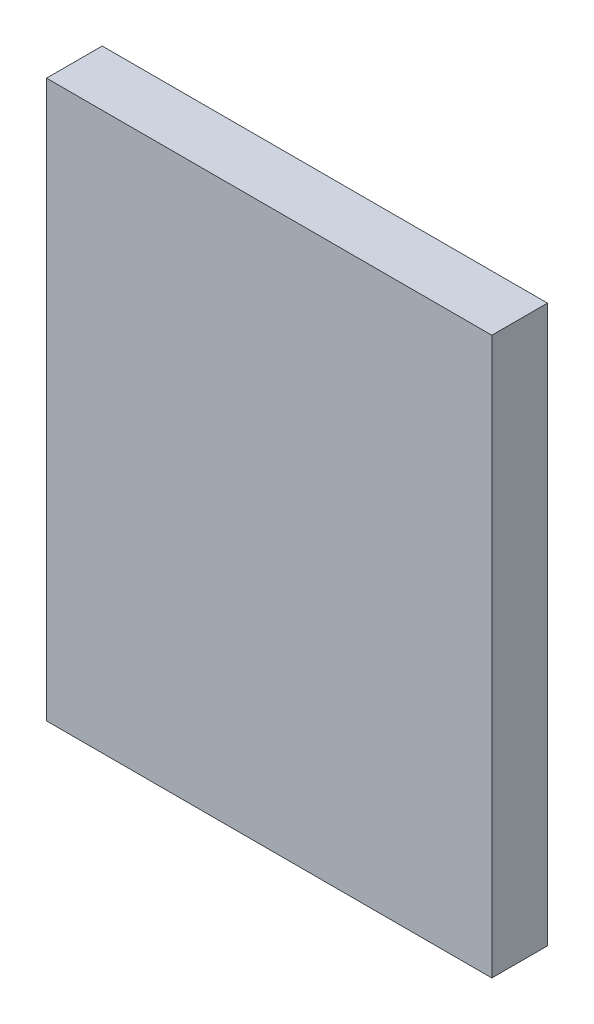
ISO-10303-21;
HEADER;
FILE_DESCRIPTION(('STEP AP214'),'2;1');
FILE_NAME('part.step','',(''),(''),'','','');
FILE_SCHEMA(('AUTOMOTIVE_DESIGN { 1 0 10303 214 1 1 1 1 }'));
ENDSEC;
DATA;
#1=APPLICATION_CONTEXT('core data for automotive mechanical design processes');
#2=APPLICATION_PROTOCOL_DEFINITION('international standard','automotive_design',2000,#1);
#3=PRODUCT_CONTEXT('',#1,'mechanical');
#4=PRODUCT('Part','Part','',(#3));
#5=PRODUCT_RELATED_PRODUCT_CATEGORY('part','',(#4));
#6=PRODUCT_DEFINITION_FORMATION('','',#4);
#7=PRODUCT_DEFINITION_CONTEXT('part definition',#1,'design');
#8=PRODUCT_DEFINITION('design','',#6,#7);
#9=PRODUCT_DEFINITION_SHAPE('','',#8);
#10=(LENGTH_UNIT() NAMED_UNIT(*) SI_UNIT(.MILLI.,.METRE.));
#11=(NAMED_UNIT(*) PLANE_ANGLE_UNIT() SI_UNIT($,.RADIAN.));
#12=(NAMED_UNIT(*) SI_UNIT($,.STERADIAN.) SOLID_ANGLE_UNIT());
#13=UNCERTAINTY_MEASURE_WITH_UNIT(LENGTH_MEASURE(1.E-05),#10,'distance_accuracy_value','');
#14=(GEOMETRIC_REPRESENTATION_CONTEXT(3) GLOBAL_UNCERTAINTY_ASSIGNED_CONTEXT((#13)) GLOBAL_UNIT_ASSIGNED_CONTEXT((#10,
#11,#12)) REPRESENTATION_CONTEXT('',''));
#15=CARTESIAN_POINT('',(0.,0.,0.));
#16=DIRECTION('',(0.,0.,1.));
#17=DIRECTION('',(1.,0.,0.));
#18=AXIS2_PLACEMENT_3D('',#15,#16,#17);
#19=CARTESIAN_POINT('',(12.,-15.,3.));
#20=DIRECTION('',(-1.,0.,0.));
#21=DIRECTION('',(0.,0.,1.));
#22=AXIS2_PLACEMENT_3D('',#19,#20,#21);
#23=PLANE('',#22);
#24=DIRECTION('',(0.,1.,0.));
#25=VECTOR('',#24,1.);
#26=CARTESIAN_POINT('',(12.,-15.,0.));
#27=LINE('',#26,#25);
#28=CARTESIAN_POINT('',(12.,-15.,0.));
#29=VERTEX_POINT('',#28);
#30=CARTESIAN_POINT('',(12.,15.,0.));
#31=VERTEX_POINT('',#30);
#32=EDGE_CURVE('E111',#29,#31,#27,.T.);
#33=ORIENTED_EDGE('',*,*,#32,.T.);
#34=DIRECTION('',(0.,0.,-1.));
#35=VECTOR('',#34,1.);
#36=CARTESIAN_POINT('',(12.,15.,3.));
#37=LINE('',#36,#35);
#38=CARTESIAN_POINT('',(12.,15.,3.));
#39=VERTEX_POINT('',#38);
#40=EDGE_CURVE('E11',#39,#31,#37,.T.);
#41=ORIENTED_EDGE('',*,*,#40,.F.);
#42=DIRECTION('',(0.,1.,0.));
#43=VECTOR('',#42,1.);
#44=CARTESIAN_POINT('',(12.,-15.,3.));
#45=LINE('',#44,#43);
#46=CARTESIAN_POINT('',(12.,-15.,3.));
#47=VERTEX_POINT('',#46);
#48=EDGE_CURVE('E95',#47,#39,#45,.T.);
#49=ORIENTED_EDGE('',*,*,#48,.F.);
#50=DIRECTION('',(0.,0.,-1.));
#51=VECTOR('',#50,1.);
#52=CARTESIAN_POINT('',(12.,-15.,3.));
#53=LINE('',#52,#51);
#54=EDGE_CURVE('E107',#47,#29,#53,.T.);
#55=ORIENTED_EDGE('',*,*,#54,.T.);
#56=EDGE_LOOP('',(#33,#41,#49,#55));
#57=FACE_BOUND('',#56,.T.);
#58=ADVANCED_FACE('F43',(#57),#23,.F.);
#59=CARTESIAN_POINT('',(-12.,15.,3.));
#60=DIRECTION('',(0.,-1.,0.));
#61=DIRECTION('',(0.,0.,-1.));
#62=AXIS2_PLACEMENT_3D('',#59,#60,#61);
#63=PLANE('',#62);
#64=DIRECTION('',(-1.,0.,0.));
#65=VECTOR('',#64,1.);
#66=CARTESIAN_POINT('',(-12.,15.,0.));
#67=LINE('',#66,#65);
#68=CARTESIAN_POINT('',(-12.,15.,0.));
#69=VERTEX_POINT('',#68);
#70=EDGE_CURVE('E100',#31,#69,#67,.T.);
#71=ORIENTED_EDGE('',*,*,#70,.T.);
#72=DIRECTION('',(0.,0.,-1.));
#73=VECTOR('',#72,1.);
#74=CARTESIAN_POINT('',(-12.,15.,3.));
#75=LINE('',#74,#73);
#76=CARTESIAN_POINT('',(-12.,15.,3.));
#77=VERTEX_POINT('',#76);
#78=EDGE_CURVE('E52',#77,#69,#75,.T.);
#79=ORIENTED_EDGE('',*,*,#78,.F.);
#80=DIRECTION('',(-1.,0.,0.));
#81=VECTOR('',#80,1.);
#82=CARTESIAN_POINT('',(-12.,15.,3.));
#83=LINE('',#82,#81);
#84=EDGE_CURVE('E90',#39,#77,#83,.T.);
#85=ORIENTED_EDGE('',*,*,#84,.F.);
#86=ORIENTED_EDGE('',*,*,#40,.T.);
#87=EDGE_LOOP('',(#71,#79,#85,#86));
#88=FACE_BOUND('',#87,.T.);
#89=ADVANCED_FACE('F99',(#88),#63,.F.);
#90=CARTESIAN_POINT('',(-12.,-15.,3.));
#91=DIRECTION('',(1.,0.,0.));
#92=DIRECTION('',(0.,0.,-1.));
#93=AXIS2_PLACEMENT_3D('',#90,#91,#92);
#94=PLANE('',#93);
#95=DIRECTION('',(0.,-1.,0.));
#96=VECTOR('',#95,1.);
#97=CARTESIAN_POINT('',(-12.,-15.,0.));
#98=LINE('',#97,#96);
#99=CARTESIAN_POINT('',(-12.,-15.,0.));
#100=VERTEX_POINT('',#99);
#101=EDGE_CURVE('E77',#69,#100,#98,.T.);
#102=ORIENTED_EDGE('',*,*,#101,.T.);
#103=DIRECTION('',(0.,0.,-1.));
#104=VECTOR('',#103,1.);
#105=CARTESIAN_POINT('',(-12.,-15.,3.));
#106=LINE('',#105,#104);
#107=CARTESIAN_POINT('',(-12.,-15.,3.));
#108=VERTEX_POINT('',#107);
#109=EDGE_CURVE('E102',#108,#100,#106,.T.);
#110=ORIENTED_EDGE('',*,*,#109,.F.);
#111=DIRECTION('',(0.,-1.,0.));
#112=VECTOR('',#111,1.);
#113=CARTESIAN_POINT('',(-12.,-15.,3.));
#114=LINE('',#113,#112);
#115=EDGE_CURVE('E93',#77,#108,#114,.T.);
#116=ORIENTED_EDGE('',*,*,#115,.F.);
#117=ORIENTED_EDGE('',*,*,#78,.T.);
#118=EDGE_LOOP('',(#102,#110,#116,#117));
#119=FACE_BOUND('',#118,.T.);
#120=ADVANCED_FACE('F103',(#119),#94,.F.);
#121=CARTESIAN_POINT('',(-12.,-15.,3.));
#122=DIRECTION('',(0.,1.,0.));
#123=DIRECTION('',(0.,0.,1.));
#124=AXIS2_PLACEMENT_3D('',#121,#122,#123);
#125=PLANE('',#124);
#126=DIRECTION('',(1.,0.,0.));
#127=VECTOR('',#126,1.);
#128=CARTESIAN_POINT('',(-12.,-15.,0.));
#129=LINE('',#128,#127);
#130=EDGE_CURVE('E83',#100,#29,#129,.T.);
#131=ORIENTED_EDGE('',*,*,#130,.T.);
#132=ORIENTED_EDGE('',*,*,#54,.F.);
#133=DIRECTION('',(1.,0.,0.));
#134=VECTOR('',#133,1.);
#135=CARTESIAN_POINT('',(-12.,-15.,3.));
#136=LINE('',#135,#134);
#137=EDGE_CURVE('E60',#108,#47,#136,.T.);
#138=ORIENTED_EDGE('',*,*,#137,.F.);
#139=ORIENTED_EDGE('',*,*,#109,.T.);
#140=EDGE_LOOP('',(#131,#132,#138,#139));
#141=FACE_BOUND('',#140,.T.);
#142=ADVANCED_FACE('F124',(#141),#125,.F.);
#143=CARTESIAN_POINT('',(0.,0.,3.));
#144=DIRECTION('',(0.,0.,-1.));
#145=DIRECTION('',(-1.,0.,0.));
#146=AXIS2_PLACEMENT_3D('',#143,#144,#145);
#147=PLANE('',#146);
#148=ORIENTED_EDGE('',*,*,#48,.T.);
#149=ORIENTED_EDGE('',*,*,#84,.T.);
#150=ORIENTED_EDGE('',*,*,#115,.T.);
#151=ORIENTED_EDGE('',*,*,#137,.T.);
#152=EDGE_LOOP('',(#148,#149,#150,#151));
#153=FACE_BOUND('',#152,.T.);
#154=ADVANCED_FACE('F91',(#153),#147,.F.);
#155=CARTESIAN_POINT('',(0.,0.,0.));
#156=DIRECTION('',(0.,0.,-1.));
#157=DIRECTION('',(-1.,0.,0.));
#158=AXIS2_PLACEMENT_3D('',#155,#156,#157);
#159=PLANE('',#158);
#160=ORIENTED_EDGE('',*,*,#32,.F.);
#161=ORIENTED_EDGE('',*,*,#130,.F.);
#162=ORIENTED_EDGE('',*,*,#101,.F.);
#163=ORIENTED_EDGE('',*,*,#70,.F.);
#164=EDGE_LOOP('',(#160,#161,#162,#163));
#165=FACE_BOUND('',#164,.T.);
#166=ADVANCED_FACE('F127',(#165),#159,.T.);
#167=CLOSED_SHELL('',(#58,#89,#120,#142,#154,#166));
#168=MANIFOLD_SOLID_BREP('B2',#167);
#169=ADVANCED_BREP_SHAPE_REPRESENTATION('',(#18,#168),#14);
#170=SHAPE_DEFINITION_REPRESENTATION(#9,#169);
ENDSEC;
END-ISO-10303-21;
